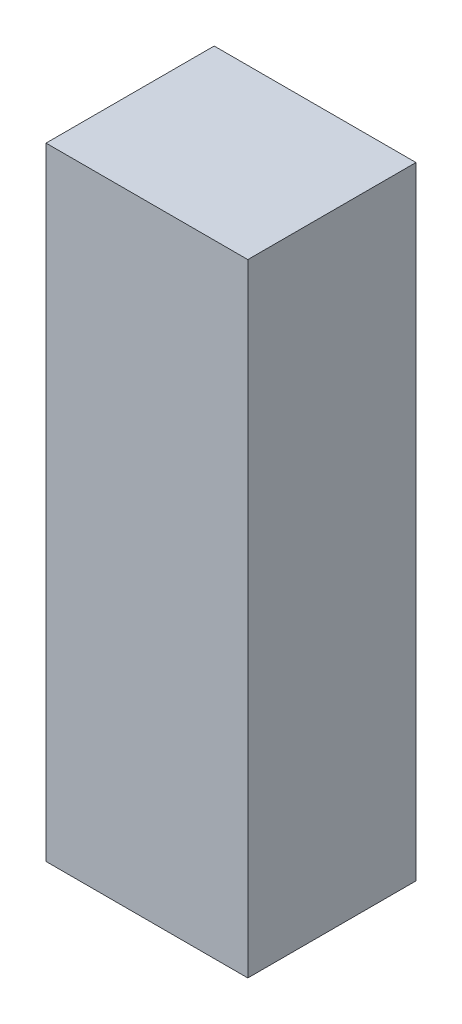
ISO-10303-21;
HEADER;
FILE_DESCRIPTION(('STEP AP214'),'2;1');
FILE_NAME('part.step','',(''),(''),'','','');
FILE_SCHEMA(('AUTOMOTIVE_DESIGN { 1 0 10303 214 1 1 1 1 }'));
ENDSEC;
DATA;
#1=APPLICATION_CONTEXT('core data for automotive mechanical design processes');
#2=APPLICATION_PROTOCOL_DEFINITION('international standard','automotive_design',2000,#1);
#3=PRODUCT_CONTEXT('',#1,'mechanical');
#4=PRODUCT('Part','Part','',(#3));
#5=PRODUCT_RELATED_PRODUCT_CATEGORY('part','',(#4));
#6=PRODUCT_DEFINITION_FORMATION('','',#4);
#7=PRODUCT_DEFINITION_CONTEXT('part definition',#1,'design');
#8=PRODUCT_DEFINITION('design','',#6,#7);
#9=PRODUCT_DEFINITION_SHAPE('','',#8);
#10=(LENGTH_UNIT() NAMED_UNIT(*) SI_UNIT(.MILLI.,.METRE.));
#11=(NAMED_UNIT(*) PLANE_ANGLE_UNIT() SI_UNIT($,.RADIAN.));
#12=(NAMED_UNIT(*) SI_UNIT($,.STERADIAN.) SOLID_ANGLE_UNIT());
#13=UNCERTAINTY_MEASURE_WITH_UNIT(LENGTH_MEASURE(1.E-05),#10,'distance_accuracy_value','');
#14=(GEOMETRIC_REPRESENTATION_CONTEXT(3) GLOBAL_UNCERTAINTY_ASSIGNED_CONTEXT((#13)) GLOBAL_UNIT_ASSIGNED_CONTEXT((#10,
#11,#12)) REPRESENTATION_CONTEXT('',''));
#15=CARTESIAN_POINT('',(0.,0.,0.));
#16=DIRECTION('',(0.,0.,1.));
#17=DIRECTION('',(1.,0.,0.));
#18=AXIS2_PLACEMENT_3D('',#15,#16,#17);
#19=CARTESIAN_POINT('',(-0.06,0.115,0.));
#20=DIRECTION('',(1.,0.,0.));
#21=DIRECTION('',(0.,0.,1.));
#22=AXIS2_PLACEMENT_3D('',#19,#20,#21);
#23=PLANE('',#22);
#24=DIRECTION('',(0.,1.,0.));
#25=VECTOR('',#24,1.);
#26=CARTESIAN_POINT('',(-0.06,0.115,0.1));
#27=LINE('',#26,#25);
#28=CARTESIAN_POINT('',(-0.06,0.115,0.1));
#29=VERTEX_POINT('',#28);
#30=CARTESIAN_POINT('',(-0.06,0.485,0.1));
#31=VERTEX_POINT('',#30);
#32=EDGE_CURVE('E11',#29,#31,#27,.T.);
#33=ORIENTED_EDGE('',*,*,#32,.T.);
#34=DIRECTION('',(0.,0.,1.));
#35=VECTOR('',#34,1.);
#36=CARTESIAN_POINT('',(-0.06,0.485,0.));
#37=LINE('',#36,#35);
#38=CARTESIAN_POINT('',(-0.06,0.485,0.));
#39=VERTEX_POINT('',#38);
#40=EDGE_CURVE('E24',#39,#31,#37,.T.);
#41=ORIENTED_EDGE('',*,*,#40,.F.);
#42=DIRECTION('',(0.,1.,0.));
#43=VECTOR('',#42,1.);
#44=CARTESIAN_POINT('',(-0.06,0.115,0.));
#45=LINE('',#44,#43);
#46=CARTESIAN_POINT('',(-0.06,0.115,0.));
#47=VERTEX_POINT('',#46);
#48=EDGE_CURVE('E86',#47,#39,#45,.T.);
#49=ORIENTED_EDGE('',*,*,#48,.F.);
#50=DIRECTION('',(0.,0.,1.));
#51=VECTOR('',#50,1.);
#52=CARTESIAN_POINT('',(-0.06,0.115,0.));
#53=LINE('',#52,#51);
#54=EDGE_CURVE('E36',#47,#29,#53,.T.);
#55=ORIENTED_EDGE('',*,*,#54,.T.);
#56=EDGE_LOOP('',(#33,#41,#49,#55));
#57=FACE_BOUND('',#56,.T.);
#58=ADVANCED_FACE('F17',(#57),#23,.F.);
#59=CARTESIAN_POINT('',(0.06,0.115,0.));
#60=DIRECTION('',(1.,0.,0.));
#61=DIRECTION('',(0.,0.,1.));
#62=AXIS2_PLACEMENT_3D('',#59,#60,#61);
#63=PLANE('',#62);
#64=DIRECTION('',(0.,0.,1.));
#65=VECTOR('',#64,1.);
#66=CARTESIAN_POINT('',(0.06,0.115,0.));
#67=LINE('',#66,#65);
#68=CARTESIAN_POINT('',(0.06,0.115,0.));
#69=VERTEX_POINT('',#68);
#70=CARTESIAN_POINT('',(0.06,0.115,0.1));
#71=VERTEX_POINT('',#70);
#72=EDGE_CURVE('E83',#69,#71,#67,.T.);
#73=ORIENTED_EDGE('',*,*,#72,.F.);
#74=DIRECTION('',(0.,1.,0.));
#75=VECTOR('',#74,1.);
#76=CARTESIAN_POINT('',(0.06,0.115,0.));
#77=LINE('',#76,#75);
#78=CARTESIAN_POINT('',(0.06,0.485,0.));
#79=VERTEX_POINT('',#78);
#80=EDGE_CURVE('E63',#69,#79,#77,.T.);
#81=ORIENTED_EDGE('',*,*,#80,.T.);
#82=DIRECTION('',(0.,0.,1.));
#83=VECTOR('',#82,1.);
#84=CARTESIAN_POINT('',(0.06,0.485,0.));
#85=LINE('',#84,#83);
#86=CARTESIAN_POINT('',(0.06,0.485,0.1));
#87=VERTEX_POINT('',#86);
#88=EDGE_CURVE('E57',#79,#87,#85,.T.);
#89=ORIENTED_EDGE('',*,*,#88,.T.);
#90=DIRECTION('',(0.,1.,0.));
#91=VECTOR('',#90,1.);
#92=CARTESIAN_POINT('',(0.06,0.115,0.1));
#93=LINE('',#92,#91);
#94=EDGE_CURVE('E60',#71,#87,#93,.T.);
#95=ORIENTED_EDGE('',*,*,#94,.F.);
#96=EDGE_LOOP('',(#73,#81,#89,#95));
#97=FACE_BOUND('',#96,.T.);
#98=ADVANCED_FACE('F59',(#97),#63,.T.);
#99=CARTESIAN_POINT('',(-0.06,0.115,0.));
#100=DIRECTION('',(0.,1.,0.));
#101=DIRECTION('',(0.,0.,1.));
#102=AXIS2_PLACEMENT_3D('',#99,#100,#101);
#103=PLANE('',#102);
#104=ORIENTED_EDGE('',*,*,#72,.T.);
#105=DIRECTION('',(1.,0.,0.));
#106=VECTOR('',#105,1.);
#107=CARTESIAN_POINT('',(-0.06,0.115,0.1));
#108=LINE('',#107,#106);
#109=EDGE_CURVE('E71',#29,#71,#108,.T.);
#110=ORIENTED_EDGE('',*,*,#109,.F.);
#111=ORIENTED_EDGE('',*,*,#54,.F.);
#112=DIRECTION('',(1.,0.,0.));
#113=VECTOR('',#112,1.);
#114=CARTESIAN_POINT('',(-0.06,0.115,0.));
#115=LINE('',#114,#113);
#116=EDGE_CURVE('E76',#47,#69,#115,.T.);
#117=ORIENTED_EDGE('',*,*,#116,.T.);
#118=EDGE_LOOP('',(#104,#110,#111,#117));
#119=FACE_BOUND('',#118,.T.);
#120=ADVANCED_FACE('F91',(#119),#103,.F.);
#121=CARTESIAN_POINT('',(-0.06,0.485,0.));
#122=DIRECTION('',(0.,1.,0.));
#123=DIRECTION('',(0.,0.,1.));
#124=AXIS2_PLACEMENT_3D('',#121,#122,#123);
#125=PLANE('',#124);
#126=DIRECTION('',(1.,0.,0.));
#127=VECTOR('',#126,1.);
#128=CARTESIAN_POINT('',(-0.06,0.485,0.));
#129=LINE('',#128,#127);
#130=EDGE_CURVE('E74',#39,#79,#129,.T.);
#131=ORIENTED_EDGE('',*,*,#130,.F.);
#132=ORIENTED_EDGE('',*,*,#40,.T.);
#133=DIRECTION('',(1.,0.,0.));
#134=VECTOR('',#133,1.);
#135=CARTESIAN_POINT('',(-0.06,0.485,0.1));
#136=LINE('',#135,#134);
#137=EDGE_CURVE('E69',#31,#87,#136,.T.);
#138=ORIENTED_EDGE('',*,*,#137,.T.);
#139=ORIENTED_EDGE('',*,*,#88,.F.);
#140=EDGE_LOOP('',(#131,#132,#138,#139));
#141=FACE_BOUND('',#140,.T.);
#142=ADVANCED_FACE('F73',(#141),#125,.T.);
#143=CARTESIAN_POINT('',(-0.06,0.115,0.));
#144=DIRECTION('',(0.,0.,1.));
#145=DIRECTION('',(1.,0.,0.));
#146=AXIS2_PLACEMENT_3D('',#143,#144,#145);
#147=PLANE('',#146);
#148=ORIENTED_EDGE('',*,*,#130,.T.);
#149=ORIENTED_EDGE('',*,*,#80,.F.);
#150=ORIENTED_EDGE('',*,*,#116,.F.);
#151=ORIENTED_EDGE('',*,*,#48,.T.);
#152=EDGE_LOOP('',(#148,#149,#150,#151));
#153=FACE_BOUND('',#152,.T.);
#154=ADVANCED_FACE('F89',(#153),#147,.F.);
#155=CARTESIAN_POINT('',(-0.06,0.115,0.1));
#156=DIRECTION('',(0.,0.,1.));
#157=DIRECTION('',(1.,0.,0.));
#158=AXIS2_PLACEMENT_3D('',#155,#156,#157);
#159=PLANE('',#158);
#160=ORIENTED_EDGE('',*,*,#32,.F.);
#161=ORIENTED_EDGE('',*,*,#109,.T.);
#162=ORIENTED_EDGE('',*,*,#94,.T.);
#163=ORIENTED_EDGE('',*,*,#137,.F.);
#164=EDGE_LOOP('',(#160,#161,#162,#163));
#165=FACE_BOUND('',#164,.T.);
#166=ADVANCED_FACE('F68',(#165),#159,.T.);
#167=CLOSED_SHELL('',(#58,#98,#120,#142,#154,#166));
#168=MANIFOLD_SOLID_BREP('B1',#167);
#169=ADVANCED_BREP_SHAPE_REPRESENTATION('',(#18,#168),#14);
#170=SHAPE_DEFINITION_REPRESENTATION(#9,#169);
ENDSEC;
END-ISO-10303-21;
